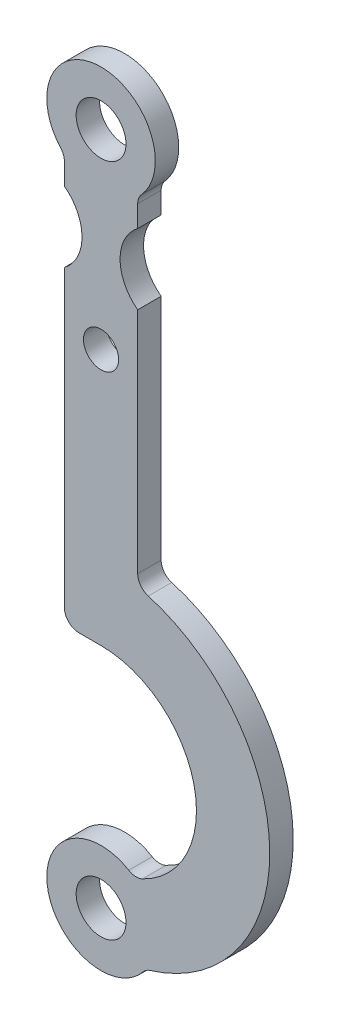
ISO-10303-21;
HEADER;
FILE_DESCRIPTION(('STEP AP214'),'2;1');
FILE_NAME('part.step','',(''),(''),'','','');
FILE_SCHEMA(('AUTOMOTIVE_DESIGN { 1 0 10303 214 1 1 1 1 }'));
ENDSEC;
DATA;
#1=APPLICATION_CONTEXT('core data for automotive mechanical design processes');
#2=APPLICATION_PROTOCOL_DEFINITION('international standard','automotive_design',2000,#1);
#3=PRODUCT_CONTEXT('',#1,'mechanical');
#4=PRODUCT('Part','Part','',(#3));
#5=PRODUCT_RELATED_PRODUCT_CATEGORY('part','',(#4));
#6=PRODUCT_DEFINITION_FORMATION('','',#4);
#7=PRODUCT_DEFINITION_CONTEXT('part definition',#1,'design');
#8=PRODUCT_DEFINITION('design','',#6,#7);
#9=PRODUCT_DEFINITION_SHAPE('','',#8);
#10=(LENGTH_UNIT() NAMED_UNIT(*) SI_UNIT(.MILLI.,.METRE.));
#11=(NAMED_UNIT(*) PLANE_ANGLE_UNIT() SI_UNIT($,.RADIAN.));
#12=(NAMED_UNIT(*) SI_UNIT($,.STERADIAN.) SOLID_ANGLE_UNIT());
#13=UNCERTAINTY_MEASURE_WITH_UNIT(LENGTH_MEASURE(1.E-05),#10,'distance_accuracy_value','');
#14=(GEOMETRIC_REPRESENTATION_CONTEXT(3) GLOBAL_UNCERTAINTY_ASSIGNED_CONTEXT((#13)) GLOBAL_UNIT_ASSIGNED_CONTEXT((#10,
#11,#12)) REPRESENTATION_CONTEXT('',''));
#15=CARTESIAN_POINT('',(0.,0.,0.));
#16=DIRECTION('',(0.,0.,1.));
#17=DIRECTION('',(1.,0.,0.));
#18=AXIS2_PLACEMENT_3D('',#15,#16,#17);
#19=CARTESIAN_POINT('',(0.,-230.,8.));
#20=DIRECTION('',(0.,0.,-1.));
#21=DIRECTION('',(-1.,0.,0.));
#22=AXIS2_PLACEMENT_3D('',#19,#20,#21);
#23=CYLINDRICAL_SURFACE('',#22,18.5);
#24=CARTESIAN_POINT('',(0.,-230.,0.));
#25=DIRECTION('',(0.,0.,1.));
#26=DIRECTION('',(1.,0.,0.));
#27=AXIS2_PLACEMENT_3D('',#24,#25,#26);
#28=CIRCLE('',#27,18.5);
#29=CARTESIAN_POINT('',(9.44463891587366,-214.092492472145,0.));
#30=VERTEX_POINT('',#29);
#31=CARTESIAN_POINT('',(14.3530284553606,-241.672213764304,0.));
#32=VERTEX_POINT('',#31);
#33=EDGE_CURVE('E240',#30,#32,#28,.T.);
#34=ORIENTED_EDGE('',*,*,#33,.T.);
#35=DIRECTION('',(0.,0.,-1.));
#36=VECTOR('',#35,1.);
#37=CARTESIAN_POINT('',(14.3530284553606,-241.672213764304,8.));
#38=LINE('',#37,#36);
#39=CARTESIAN_POINT('',(14.3530284553606,-241.672213764304,8.));
#40=VERTEX_POINT('',#39);
#41=EDGE_CURVE('E299',#32,#40,#38,.F.);
#42=ORIENTED_EDGE('',*,*,#41,.T.);
#43=CARTESIAN_POINT('',(0.,-230.,8.));
#44=DIRECTION('',(0.,0.,1.));
#45=DIRECTION('',(1.,0.,0.));
#46=AXIS2_PLACEMENT_3D('',#43,#44,#45);
#47=CIRCLE('',#46,18.5);
#48=CARTESIAN_POINT('',(9.44463891587366,-214.092492472145,8.));
#49=VERTEX_POINT('',#48);
#50=EDGE_CURVE('E445',#49,#40,#47,.T.);
#51=ORIENTED_EDGE('',*,*,#50,.F.);
#52=DIRECTION('',(0.,0.,-1.));
#53=VECTOR('',#52,1.);
#54=CARTESIAN_POINT('',(9.44463891587366,-214.092492472145,8.));
#55=LINE('',#54,#53);
#56=EDGE_CURVE('E295',#49,#30,#55,.T.);
#57=ORIENTED_EDGE('',*,*,#56,.T.);
#58=EDGE_LOOP('',(#34,#42,#51,#57));
#59=FACE_BOUND('',#58,.T.);
#60=ADVANCED_FACE('F49',(#59),#23,.T.);
#61=CARTESIAN_POINT('',(0.,-185.,8.));
#62=DIRECTION('',(0.,0.,-1.));
#63=DIRECTION('',(-1.,0.,0.));
#64=AXIS2_PLACEMENT_3D('',#61,#62,#63);
#65=CYLINDRICAL_SURFACE('',#64,57.5433285968466);
#66=CARTESIAN_POINT('',(0.,-185.,8.));
#67=DIRECTION('',(0.,0.,1.));
#68=DIRECTION('',(1.,0.,0.));
#69=AXIS2_PLACEMENT_3D('',#66,#67,#68);
#70=CIRCLE('',#69,57.5433285968466);
#71=CARTESIAN_POINT('',(16.7746577780857,-240.044032577862,8.));
#72=VERTEX_POINT('',#71);
#73=CARTESIAN_POINT('',(16.1009698881871,-129.755150152577,8.));
#74=VERTEX_POINT('',#73);
#75=EDGE_CURVE('E194',#72,#74,#70,.T.);
#76=ORIENTED_EDGE('',*,*,#75,.F.);
#77=DIRECTION('',(0.,0.,-1.));
#78=VECTOR('',#77,1.);
#79=CARTESIAN_POINT('',(16.7746577780857,-240.044032577862,8.));
#80=LINE('',#79,#78);
#81=CARTESIAN_POINT('',(16.7746577780857,-240.044032577862,0.));
#82=VERTEX_POINT('',#81);
#83=EDGE_CURVE('E291',#72,#82,#80,.T.);
#84=ORIENTED_EDGE('',*,*,#83,.T.);
#85=CARTESIAN_POINT('',(0.,-185.,0.));
#86=DIRECTION('',(0.,0.,1.));
#87=DIRECTION('',(1.,0.,0.));
#88=AXIS2_PLACEMENT_3D('',#85,#86,#87);
#89=CIRCLE('',#88,57.5433285968466);
#90=CARTESIAN_POINT('',(16.1009698881871,-129.755150152577,0.));
#91=VERTEX_POINT('',#90);
#92=EDGE_CURVE('E244',#82,#91,#89,.T.);
#93=ORIENTED_EDGE('',*,*,#92,.T.);
#94=DIRECTION('',(0.,0.,-1.));
#95=VECTOR('',#94,1.);
#96=CARTESIAN_POINT('',(16.1009698881871,-129.755150152577,8.));
#97=LINE('',#96,#95);
#98=EDGE_CURVE('E183',#91,#74,#97,.F.);
#99=ORIENTED_EDGE('',*,*,#98,.T.);
#100=EDGE_LOOP('',(#76,#84,#93,#99));
#101=FACE_BOUND('',#100,.T.);
#102=ADVANCED_FACE('F363',(#101),#65,.T.);
#103=CARTESIAN_POINT('',(12.5,0.,8.));
#104=DIRECTION('',(1.,0.,0.));
#105=DIRECTION('',(0.,1.,0.));
#106=AXIS2_PLACEMENT_3D('',#103,#104,#105);
#107=PLANE('',#106);
#108=DIRECTION('',(0.,-1.,0.));
#109=VECTOR('',#108,1.);
#110=CARTESIAN_POINT('',(12.5,0.,8.));
#111=LINE('',#110,#109);
#112=CARTESIAN_POINT('',(12.5,-47.,8.));
#113=VERTEX_POINT('',#112);
#114=CARTESIAN_POINT('',(12.5,-124.954867374839,8.));
#115=VERTEX_POINT('',#114);
#116=EDGE_CURVE('E174',#113,#115,#111,.T.);
#117=ORIENTED_EDGE('',*,*,#116,.T.);
#118=DIRECTION('',(0.,0.,-1.));
#119=VECTOR('',#118,1.);
#120=CARTESIAN_POINT('',(12.5,-124.954867374839,8.));
#121=LINE('',#120,#119);
#122=CARTESIAN_POINT('',(12.5,-124.954867374839,0.));
#123=VERTEX_POINT('',#122);
#124=EDGE_CURVE('E319',#115,#123,#121,.T.);
#125=ORIENTED_EDGE('',*,*,#124,.T.);
#126=DIRECTION('',(0.,-1.,0.));
#127=VECTOR('',#126,1.);
#128=CARTESIAN_POINT('',(12.5,0.,0.));
#129=LINE('',#128,#127);
#130=CARTESIAN_POINT('',(12.5,-47.,0.));
#131=VERTEX_POINT('',#130);
#132=EDGE_CURVE('E177',#131,#123,#129,.T.);
#133=ORIENTED_EDGE('',*,*,#132,.F.);
#134=DIRECTION('',(0.,0.,-1.));
#135=VECTOR('',#134,1.);
#136=CARTESIAN_POINT('',(12.5,-47.,8.));
#137=LINE('',#136,#135);
#138=EDGE_CURVE('E170',#113,#131,#137,.T.);
#139=ORIENTED_EDGE('',*,*,#138,.F.);
#140=EDGE_LOOP('',(#117,#125,#133,#139));
#141=FACE_BOUND('',#140,.T.);
#142=ADVANCED_FACE('F172',(#141),#107,.T.);
#143=CARTESIAN_POINT('',(21.5,-35.,8.));
#144=DIRECTION('',(0.,0.,-1.));
#145=DIRECTION('',(-1.,0.,0.));
#146=AXIS2_PLACEMENT_3D('',#143,#144,#145);
#147=CYLINDRICAL_SURFACE('',#146,15.);
#148=CARTESIAN_POINT('',(21.5,-35.,0.));
#149=DIRECTION('',(0.,0.,1.));
#150=DIRECTION('',(1.,0.,0.));
#151=AXIS2_PLACEMENT_3D('',#148,#149,#150);
#152=CIRCLE('',#151,15.);
#153=CARTESIAN_POINT('',(12.5,-23.,0.));
#154=VERTEX_POINT('',#153);
#155=EDGE_CURVE('E250',#154,#131,#152,.T.);
#156=ORIENTED_EDGE('',*,*,#155,.F.);
#157=DIRECTION('',(0.,0.,-1.));
#158=VECTOR('',#157,1.);
#159=CARTESIAN_POINT('',(12.5,-23.,8.));
#160=LINE('',#159,#158);
#161=CARTESIAN_POINT('',(12.5,-23.,8.));
#162=VERTEX_POINT('',#161);
#163=EDGE_CURVE('E184',#162,#154,#160,.T.);
#164=ORIENTED_EDGE('',*,*,#163,.F.);
#165=CARTESIAN_POINT('',(21.5,-35.,8.));
#166=DIRECTION('',(0.,0.,1.));
#167=DIRECTION('',(1.,0.,0.));
#168=AXIS2_PLACEMENT_3D('',#165,#166,#167);
#169=CIRCLE('',#168,15.);
#170=EDGE_CURVE('E190',#162,#113,#169,.T.);
#171=ORIENTED_EDGE('',*,*,#170,.T.);
#172=ORIENTED_EDGE('',*,*,#138,.T.);
#173=EDGE_LOOP('',(#156,#164,#171,#172));
#174=FACE_BOUND('',#173,.T.);
#175=ADVANCED_FACE('F197',(#174),#147,.F.);
#176=CARTESIAN_POINT('',(12.5,0.,8.));
#177=DIRECTION('',(1.,0.,0.));
#178=DIRECTION('',(0.,1.,0.));
#179=AXIS2_PLACEMENT_3D('',#176,#177,#178);
#180=PLANE('',#179);
#181=DIRECTION('',(0.,-1.,0.));
#182=VECTOR('',#181,1.);
#183=CARTESIAN_POINT('',(12.5,0.,0.));
#184=LINE('',#183,#182);
#185=CARTESIAN_POINT('',(12.5,-15.6843871413581,0.));
#186=VERTEX_POINT('',#185);
#187=EDGE_CURVE('E253',#186,#154,#184,.T.);
#188=ORIENTED_EDGE('',*,*,#187,.F.);
#189=DIRECTION('',(0.,0.,1.));
#190=VECTOR('',#189,1.);
#191=CARTESIAN_POINT('',(12.5,-15.6843871413581,8.));
#192=LINE('',#191,#190);
#193=CARTESIAN_POINT('',(12.5,-15.6843871413581,8.));
#194=VERTEX_POINT('',#193);
#195=EDGE_CURVE('E312',#186,#194,#192,.T.);
#196=ORIENTED_EDGE('',*,*,#195,.T.);
#197=DIRECTION('',(0.,-1.,0.));
#198=VECTOR('',#197,1.);
#199=CARTESIAN_POINT('',(12.5,0.,8.));
#200=LINE('',#199,#198);
#201=EDGE_CURVE('E200',#194,#162,#200,.T.);
#202=ORIENTED_EDGE('',*,*,#201,.T.);
#203=ORIENTED_EDGE('',*,*,#163,.T.);
#204=EDGE_LOOP('',(#188,#196,#202,#203));
#205=FACE_BOUND('',#204,.T.);
#206=ADVANCED_FACE('F494',(#205),#180,.T.);
#207=CARTESIAN_POINT('',(0.,0.,8.));
#208=DIRECTION('',(0.,0.,-1.));
#209=DIRECTION('',(-1.,0.,0.));
#210=AXIS2_PLACEMENT_3D('',#207,#208,#209);
#211=CYLINDRICAL_SURFACE('',#210,18.5);
#212=CARTESIAN_POINT('',(0.,0.,8.));
#213=DIRECTION('',(0.,0.,1.));
#214=DIRECTION('',(1.,0.,0.));
#215=AXIS2_PLACEMENT_3D('',#212,#213,#214);
#216=CIRCLE('',#215,18.5);
#217=CARTESIAN_POINT('',(-13.7765957446809,-12.3472834942607,8.));
#218=VERTEX_POINT('',#217);
#219=CARTESIAN_POINT('',(13.7765957446809,-12.3472834942607,8.));
#220=VERTEX_POINT('',#219);
#221=EDGE_CURVE('E203',#218,#220,#216,.F.);
#222=ORIENTED_EDGE('',*,*,#221,.T.);
#223=DIRECTION('',(0.,0.,-1.));
#224=VECTOR('',#223,1.);
#225=CARTESIAN_POINT('',(13.7765957446809,-12.3472834942607,8.));
#226=LINE('',#225,#224);
#227=CARTESIAN_POINT('',(13.7765957446809,-12.3472834942607,0.));
#228=VERTEX_POINT('',#227);
#229=EDGE_CURVE('E308',#220,#228,#226,.T.);
#230=ORIENTED_EDGE('',*,*,#229,.T.);
#231=CARTESIAN_POINT('',(0.,0.,0.));
#232=DIRECTION('',(0.,0.,1.));
#233=DIRECTION('',(1.,0.,0.));
#234=AXIS2_PLACEMENT_3D('',#231,#232,#233);
#235=CIRCLE('',#234,18.5);
#236=CARTESIAN_POINT('',(-13.7765957446809,-12.3472834942607,0.));
#237=VERTEX_POINT('',#236);
#238=EDGE_CURVE('E256',#237,#228,#235,.F.);
#239=ORIENTED_EDGE('',*,*,#238,.F.);
#240=DIRECTION('',(0.,0.,-1.));
#241=VECTOR('',#240,1.);
#242=CARTESIAN_POINT('',(-13.7765957446809,-12.3472834942607,8.));
#243=LINE('',#242,#241);
#244=EDGE_CURVE('E305',#237,#218,#243,.F.);
#245=ORIENTED_EDGE('',*,*,#244,.T.);
#246=EDGE_LOOP('',(#222,#230,#239,#245));
#247=FACE_BOUND('',#246,.T.);
#248=ADVANCED_FACE('F417',(#247),#211,.T.);
#249=CARTESIAN_POINT('',(-12.5,0.,8.));
#250=DIRECTION('',(1.,0.,0.));
#251=DIRECTION('',(0.,1.,0.));
#252=AXIS2_PLACEMENT_3D('',#249,#250,#251);
#253=PLANE('',#252);
#254=DIRECTION('',(0.,-1.,0.));
#255=VECTOR('',#254,1.);
#256=CARTESIAN_POINT('',(-12.5,0.,8.));
#257=LINE('',#256,#255);
#258=CARTESIAN_POINT('',(-12.5,-15.6843871413581,8.));
#259=VERTEX_POINT('',#258);
#260=CARTESIAN_POINT('',(-12.5,-23.,8.));
#261=VERTEX_POINT('',#260);
#262=EDGE_CURVE('E210',#259,#261,#257,.T.);
#263=ORIENTED_EDGE('',*,*,#262,.F.);
#264=DIRECTION('',(0.,0.,-1.));
#265=VECTOR('',#264,1.);
#266=CARTESIAN_POINT('',(-12.5,-15.6843871413581,8.));
#267=LINE('',#266,#265);
#268=CARTESIAN_POINT('',(-12.5,-15.6843871413581,0.));
#269=VERTEX_POINT('',#268);
#270=EDGE_CURVE('E315',#259,#269,#267,.T.);
#271=ORIENTED_EDGE('',*,*,#270,.T.);
#272=DIRECTION('',(0.,-1.,0.));
#273=VECTOR('',#272,1.);
#274=CARTESIAN_POINT('',(-12.5,0.,0.));
#275=LINE('',#274,#273);
#276=CARTESIAN_POINT('',(-12.5,-23.,0.));
#277=VERTEX_POINT('',#276);
#278=EDGE_CURVE('E260',#269,#277,#275,.T.);
#279=ORIENTED_EDGE('',*,*,#278,.T.);
#280=DIRECTION('',(0.,0.,-1.));
#281=VECTOR('',#280,1.);
#282=CARTESIAN_POINT('',(-12.5,-23.,8.));
#283=LINE('',#282,#281);
#284=EDGE_CURVE('E283',#261,#277,#283,.T.);
#285=ORIENTED_EDGE('',*,*,#284,.F.);
#286=EDGE_LOOP('',(#263,#271,#279,#285));
#287=FACE_BOUND('',#286,.T.);
#288=ADVANCED_FACE('F424',(#287),#253,.F.);
#289=CARTESIAN_POINT('',(-21.5,-35.,8.));
#290=DIRECTION('',(0.,0.,-1.));
#291=DIRECTION('',(-1.,0.,0.));
#292=AXIS2_PLACEMENT_3D('',#289,#290,#291);
#293=CYLINDRICAL_SURFACE('',#292,15.);
#294=CARTESIAN_POINT('',(-21.5,-35.,0.));
#295=DIRECTION('',(0.,0.,1.));
#296=DIRECTION('',(1.,0.,0.));
#297=AXIS2_PLACEMENT_3D('',#294,#295,#296);
#298=CIRCLE('',#297,15.);
#299=CARTESIAN_POINT('',(-12.5,-47.,0.));
#300=VERTEX_POINT('',#299);
#301=EDGE_CURVE('E263',#277,#300,#298,.F.);
#302=ORIENTED_EDGE('',*,*,#301,.T.);
#303=DIRECTION('',(0.,0.,-1.));
#304=VECTOR('',#303,1.);
#305=CARTESIAN_POINT('',(-12.5,-47.,8.));
#306=LINE('',#305,#304);
#307=CARTESIAN_POINT('',(-12.5,-47.,8.));
#308=VERTEX_POINT('',#307);
#309=EDGE_CURVE('E279',#308,#300,#306,.T.);
#310=ORIENTED_EDGE('',*,*,#309,.F.);
#311=CARTESIAN_POINT('',(-21.5,-35.,8.));
#312=DIRECTION('',(0.,0.,1.));
#313=DIRECTION('',(1.,0.,0.));
#314=AXIS2_PLACEMENT_3D('',#311,#312,#313);
#315=CIRCLE('',#314,15.);
#316=EDGE_CURVE('E213',#261,#308,#315,.F.);
#317=ORIENTED_EDGE('',*,*,#316,.F.);
#318=ORIENTED_EDGE('',*,*,#284,.T.);
#319=EDGE_LOOP('',(#302,#310,#317,#318));
#320=FACE_BOUND('',#319,.T.);
#321=ADVANCED_FACE('F430',(#320),#293,.F.);
#322=CARTESIAN_POINT('',(-12.5,0.,8.));
#323=DIRECTION('',(1.,0.,0.));
#324=DIRECTION('',(0.,1.,0.));
#325=AXIS2_PLACEMENT_3D('',#322,#323,#324);
#326=PLANE('',#325);
#327=DIRECTION('',(0.,-1.,0.));
#328=VECTOR('',#327,1.);
#329=CARTESIAN_POINT('',(-12.5,0.,0.));
#330=LINE('',#329,#328);
#331=CARTESIAN_POINT('',(-12.5,-147.456671403153,0.));
#332=VERTEX_POINT('',#331);
#333=EDGE_CURVE('E266',#300,#332,#330,.T.);
#334=ORIENTED_EDGE('',*,*,#333,.T.);
#335=DIRECTION('',(0.,0.,-1.));
#336=VECTOR('',#335,1.);
#337=CARTESIAN_POINT('',(-12.5,-147.456671403153,8.));
#338=LINE('',#337,#336);
#339=CARTESIAN_POINT('',(-12.5,-147.456671403153,8.));
#340=VERTEX_POINT('',#339);
#341=EDGE_CURVE('E65',#332,#340,#338,.F.);
#342=ORIENTED_EDGE('',*,*,#341,.T.);
#343=DIRECTION('',(0.,-1.,0.));
#344=VECTOR('',#343,1.);
#345=CARTESIAN_POINT('',(-12.5,0.,8.));
#346=LINE('',#345,#344);
#347=EDGE_CURVE('E216',#308,#340,#346,.T.);
#348=ORIENTED_EDGE('',*,*,#347,.F.);
#349=ORIENTED_EDGE('',*,*,#309,.T.);
#350=EDGE_LOOP('',(#334,#342,#348,#349));
#351=FACE_BOUND('',#350,.T.);
#352=ADVANCED_FACE('F485',(#351),#326,.F.);
#353=CARTESIAN_POINT('',(0.,-152.456671403153,8.));
#354=DIRECTION('',(0.,-1.,0.));
#355=DIRECTION('',(0.,0.,-1.));
#356=AXIS2_PLACEMENT_3D('',#353,#354,#355);
#357=PLANE('',#356);
#358=DIRECTION('',(-1.,0.,0.));
#359=VECTOR('',#358,1.);
#360=CARTESIAN_POINT('',(0.,-152.456671403153,8.));
#361=LINE('',#360,#359);
#362=CARTESIAN_POINT('',(0.,-152.456671403153,8.));
#363=VERTEX_POINT('',#362);
#364=CARTESIAN_POINT('',(-7.49999999999999,-152.456671403153,8.));
#365=VERTEX_POINT('',#364);
#366=EDGE_CURVE('E219',#363,#365,#361,.T.);
#367=ORIENTED_EDGE('',*,*,#366,.T.);
#368=DIRECTION('',(0.,0.,-1.));
#369=VECTOR('',#368,1.);
#370=CARTESIAN_POINT('',(-7.49999999999999,-152.456671403153,0.));
#371=LINE('',#370,#369);
#372=CARTESIAN_POINT('',(-7.49999999999999,-152.456671403153,0.));
#373=VERTEX_POINT('',#372);
#374=EDGE_CURVE('E322',#365,#373,#371,.T.);
#375=ORIENTED_EDGE('',*,*,#374,.T.);
#376=DIRECTION('',(-1.,0.,0.));
#377=VECTOR('',#376,1.);
#378=CARTESIAN_POINT('',(0.,-152.456671403153,0.));
#379=LINE('',#378,#377);
#380=CARTESIAN_POINT('',(0.,-152.456671403153,0.));
#381=VERTEX_POINT('',#380);
#382=EDGE_CURVE('E269',#381,#373,#379,.T.);
#383=ORIENTED_EDGE('',*,*,#382,.F.);
#384=DIRECTION('',(0.,0.,-1.));
#385=VECTOR('',#384,1.);
#386=CARTESIAN_POINT('',(0.,-152.456671403153,8.));
#387=LINE('',#386,#385);
#388=EDGE_CURVE('E227',#363,#381,#387,.T.);
#389=ORIENTED_EDGE('',*,*,#388,.F.);
#390=EDGE_LOOP('',(#367,#375,#383,#389));
#391=FACE_BOUND('',#390,.T.);
#392=ADVANCED_FACE('F390',(#391),#357,.T.);
#393=CARTESIAN_POINT('',(0.,0.,8.));
#394=DIRECTION('',(0.,0.,-1.));
#395=DIRECTION('',(-1.,0.,0.));
#396=AXIS2_PLACEMENT_3D('',#393,#394,#395);
#397=CYLINDRICAL_SURFACE('',#396,8.5);
#398=CARTESIAN_POINT('',(0.,0.,8.));
#399=DIRECTION('',(0.,0.,1.));
#400=DIRECTION('',(1.,0.,0.));
#401=AXIS2_PLACEMENT_3D('',#398,#399,#400);
#402=CIRCLE('',#401,8.5);
#403=CARTESIAN_POINT('',(8.5,0.,8.));
#404=VERTEX_POINT('',#403);
#405=EDGE_CURVE('E449',#404,#404,#402,.T.);
#406=ORIENTED_EDGE('',*,*,#405,.T.);
#407=EDGE_LOOP('',(#406));
#408=FACE_BOUND('',#407,.T.);
#409=CARTESIAN_POINT('',(0.,0.,0.));
#410=DIRECTION('',(0.,0.,1.));
#411=DIRECTION('',(1.,0.,0.));
#412=AXIS2_PLACEMENT_3D('',#409,#410,#411);
#413=CIRCLE('',#412,8.5);
#414=CARTESIAN_POINT('',(8.5,0.,0.));
#415=VERTEX_POINT('',#414);
#416=EDGE_CURVE('E236',#415,#415,#413,.T.);
#417=ORIENTED_EDGE('',*,*,#416,.F.);
#418=EDGE_LOOP('',(#417));
#419=FACE_BOUND('',#418,.T.);
#420=ADVANCED_FACE('F386',(#408,#419),#397,.F.);
#421=CARTESIAN_POINT('',(0.,-230.,8.));
#422=DIRECTION('',(0.,0.,-1.));
#423=DIRECTION('',(-1.,0.,0.));
#424=AXIS2_PLACEMENT_3D('',#421,#422,#423);
#425=CYLINDRICAL_SURFACE('',#424,8.50000000000001);
#426=CARTESIAN_POINT('',(0.,-230.,8.));
#427=DIRECTION('',(0.,0.,1.));
#428=DIRECTION('',(1.,0.,0.));
#429=AXIS2_PLACEMENT_3D('',#426,#427,#428);
#430=CIRCLE('',#429,8.50000000000001);
#431=CARTESIAN_POINT('',(8.50000000000001,-230.,8.));
#432=VERTEX_POINT('',#431);
#433=EDGE_CURVE('E454',#432,#432,#430,.T.);
#434=ORIENTED_EDGE('',*,*,#433,.T.);
#435=EDGE_LOOP('',(#434));
#436=FACE_BOUND('',#435,.T.);
#437=CARTESIAN_POINT('',(0.,-230.,0.));
#438=DIRECTION('',(0.,0.,1.));
#439=DIRECTION('',(1.,0.,0.));
#440=AXIS2_PLACEMENT_3D('',#437,#438,#439);
#441=CIRCLE('',#440,8.50000000000001);
#442=CARTESIAN_POINT('',(8.50000000000001,-230.,0.));
#443=VERTEX_POINT('',#442);
#444=EDGE_CURVE('E232',#443,#443,#441,.T.);
#445=ORIENTED_EDGE('',*,*,#444,.F.);
#446=EDGE_LOOP('',(#445));
#447=FACE_BOUND('',#446,.T.);
#448=ADVANCED_FACE('F389',(#436,#447),#425,.F.);
#449=CARTESIAN_POINT('',(0.,-65.,8.));
#450=DIRECTION('',(0.,0.,-1.));
#451=DIRECTION('',(-1.,0.,0.));
#452=AXIS2_PLACEMENT_3D('',#449,#450,#451);
#453=CYLINDRICAL_SURFACE('',#452,6.);
#454=CARTESIAN_POINT('',(0.,-65.,8.));
#455=DIRECTION('',(0.,0.,1.));
#456=DIRECTION('',(1.,0.,0.));
#457=AXIS2_PLACEMENT_3D('',#454,#455,#456);
#458=CIRCLE('',#457,6.);
#459=CARTESIAN_POINT('',(6.,-65.,8.));
#460=VERTEX_POINT('',#459);
#461=EDGE_CURVE('E276',#460,#460,#458,.T.);
#462=ORIENTED_EDGE('',*,*,#461,.T.);
#463=EDGE_LOOP('',(#462));
#464=FACE_BOUND('',#463,.T.);
#465=CARTESIAN_POINT('',(0.,-65.,0.));
#466=DIRECTION('',(0.,0.,1.));
#467=DIRECTION('',(1.,0.,0.));
#468=AXIS2_PLACEMENT_3D('',#465,#466,#467);
#469=CIRCLE('',#468,6.);
#470=CARTESIAN_POINT('',(6.,-65.,0.));
#471=VERTEX_POINT('',#470);
#472=EDGE_CURVE('E228',#471,#471,#469,.T.);
#473=ORIENTED_EDGE('',*,*,#472,.F.);
#474=EDGE_LOOP('',(#473));
#475=FACE_BOUND('',#474,.T.);
#476=ADVANCED_FACE('F394',(#464,#475),#453,.F.);
#477=CARTESIAN_POINT('',(0.,-185.,8.));
#478=DIRECTION('',(0.,0.,-1.));
#479=DIRECTION('',(-1.,0.,0.));
#480=AXIS2_PLACEMENT_3D('',#477,#478,#479);
#481=CYLINDRICAL_SURFACE('',#480,32.5433285968467);
#482=CARTESIAN_POINT('',(0.,-185.,0.));
#483=DIRECTION('',(0.,0.,1.));
#484=DIRECTION('',(1.,0.,0.));
#485=AXIS2_PLACEMENT_3D('',#482,#483,#484);
#486=CIRCLE('',#485,32.5433285968467);
#487=CARTESIAN_POINT('',(14.1751296796172,-214.293923170657,0.));
#488=VERTEX_POINT('',#487);
#489=EDGE_CURVE('E272',#381,#488,#486,.F.);
#490=ORIENTED_EDGE('',*,*,#489,.T.);
#491=DIRECTION('',(0.,0.,-1.));
#492=VECTOR('',#491,1.);
#493=CARTESIAN_POINT('',(14.1751296796172,-214.293923170657,8.));
#494=LINE('',#493,#492);
#495=CARTESIAN_POINT('',(14.1751296796172,-214.293923170657,8.));
#496=VERTEX_POINT('',#495);
#497=EDGE_CURVE('E302',#488,#496,#494,.F.);
#498=ORIENTED_EDGE('',*,*,#497,.T.);
#499=CARTESIAN_POINT('',(0.,-185.,8.));
#500=DIRECTION('',(0.,0.,1.));
#501=DIRECTION('',(1.,0.,0.));
#502=AXIS2_PLACEMENT_3D('',#499,#500,#501);
#503=CIRCLE('',#502,32.5433285968467);
#504=EDGE_CURVE('E223',#363,#496,#503,.F.);
#505=ORIENTED_EDGE('',*,*,#504,.F.);
#506=ORIENTED_EDGE('',*,*,#388,.T.);
#507=EDGE_LOOP('',(#490,#498,#505,#506));
#508=FACE_BOUND('',#507,.T.);
#509=ADVANCED_FACE('F397',(#508),#481,.F.);
#510=CARTESIAN_POINT('',(0.,0.,8.));
#511=DIRECTION('',(0.,0.,1.));
#512=DIRECTION('',(1.,0.,0.));
#513=AXIS2_PLACEMENT_3D('',#510,#511,#512);
#514=PLANE('',#513);
#515=ORIENTED_EDGE('',*,*,#461,.F.);
#516=EDGE_LOOP('',(#515));
#517=FACE_BOUND('',#516,.T.);
#518=ORIENTED_EDGE('',*,*,#433,.F.);
#519=EDGE_LOOP('',(#518));
#520=FACE_BOUND('',#519,.T.);
#521=ORIENTED_EDGE('',*,*,#405,.F.);
#522=EDGE_LOOP('',(#521));
#523=FACE_BOUND('',#522,.T.);
#524=ORIENTED_EDGE('',*,*,#347,.T.);
#525=CARTESIAN_POINT('',(-7.49999999999999,-147.456671403153,8.));
#526=DIRECTION('',(0.,0.,1.));
#527=DIRECTION('',(1.,0.,0.));
#528=AXIS2_PLACEMENT_3D('',#525,#526,#527);
#529=CIRCLE('',#528,5.);
#530=EDGE_CURVE('E330',#340,#365,#529,.T.);
#531=ORIENTED_EDGE('',*,*,#530,.T.);
#532=ORIENTED_EDGE('',*,*,#366,.F.);
#533=ORIENTED_EDGE('',*,*,#504,.T.);
#534=CARTESIAN_POINT('',(11.997244028272,-209.793166113265,8.));
#535=DIRECTION('',(0.,0.,1.));
#536=DIRECTION('',(1.,0.,0.));
#537=AXIS2_PLACEMENT_3D('',#534,#535,#536);
#538=CIRCLE('',#537,5.);
#539=EDGE_CURVE('E342',#496,#49,#538,.F.);
#540=ORIENTED_EDGE('',*,*,#539,.T.);
#541=ORIENTED_EDGE('',*,*,#50,.T.);
#542=CARTESIAN_POINT('',(18.2322253351878,-244.826866133035,8.));
#543=DIRECTION('',(0.,0.,1.));
#544=DIRECTION('',(1.,0.,0.));
#545=AXIS2_PLACEMENT_3D('',#542,#543,#544);
#546=CIRCLE('',#545,5.);
#547=EDGE_CURVE('E336',#40,#72,#546,.F.);
#548=ORIENTED_EDGE('',*,*,#547,.T.);
#549=ORIENTED_EDGE('',*,*,#75,.T.);
#550=CARTESIAN_POINT('',(17.5,-124.954867374839,8.));
#551=DIRECTION('',(0.,0.,1.));
#552=DIRECTION('',(1.,0.,0.));
#553=AXIS2_PLACEMENT_3D('',#550,#551,#552);
#554=CIRCLE('',#553,5.);
#555=EDGE_CURVE('E11',#74,#115,#554,.F.);
#556=ORIENTED_EDGE('',*,*,#555,.T.);
#557=ORIENTED_EDGE('',*,*,#116,.F.);
#558=ORIENTED_EDGE('',*,*,#170,.F.);
#559=ORIENTED_EDGE('',*,*,#201,.F.);
#560=CARTESIAN_POINT('',(17.5,-15.6843871413581,8.));
#561=DIRECTION('',(0.,0.,1.));
#562=DIRECTION('',(1.,0.,0.));
#563=AXIS2_PLACEMENT_3D('',#560,#561,#562);
#564=CIRCLE('',#563,5.);
#565=EDGE_CURVE('E348',#194,#220,#564,.F.);
#566=ORIENTED_EDGE('',*,*,#565,.T.);
#567=ORIENTED_EDGE('',*,*,#221,.F.);
#568=CARTESIAN_POINT('',(-17.5,-15.6843871413581,8.));
#569=DIRECTION('',(0.,0.,1.));
#570=DIRECTION('',(1.,0.,0.));
#571=AXIS2_PLACEMENT_3D('',#568,#569,#570);
#572=CIRCLE('',#571,5.);
#573=EDGE_CURVE('E354',#218,#259,#572,.F.);
#574=ORIENTED_EDGE('',*,*,#573,.T.);
#575=ORIENTED_EDGE('',*,*,#262,.T.);
#576=ORIENTED_EDGE('',*,*,#316,.T.);
#577=EDGE_LOOP('',(#524,#531,#532,#533,#540,#541,#548,#549,#556,#557,#558,#559,#566,#567,#574,
#575,#576));
#578=FACE_BOUND('',#577,.T.);
#579=ADVANCED_FACE('F188',(#517,#520,#523,#578),#514,.T.);
#580=CARTESIAN_POINT('',(0.,0.,0.));
#581=DIRECTION('',(0.,0.,1.));
#582=DIRECTION('',(1.,0.,0.));
#583=AXIS2_PLACEMENT_3D('',#580,#581,#582);
#584=PLANE('',#583);
#585=ORIENTED_EDGE('',*,*,#472,.T.);
#586=EDGE_LOOP('',(#585));
#587=FACE_BOUND('',#586,.T.);
#588=ORIENTED_EDGE('',*,*,#444,.T.);
#589=EDGE_LOOP('',(#588));
#590=FACE_BOUND('',#589,.T.);
#591=ORIENTED_EDGE('',*,*,#416,.T.);
#592=EDGE_LOOP('',(#591));
#593=FACE_BOUND('',#592,.T.);
#594=ORIENTED_EDGE('',*,*,#382,.T.);
#595=CARTESIAN_POINT('',(-7.49999999999999,-147.456671403153,0.));
#596=DIRECTION('',(0.,0.,1.));
#597=DIRECTION('',(1.,0.,0.));
#598=AXIS2_PLACEMENT_3D('',#595,#596,#597);
#599=CIRCLE('',#598,5.);
#600=EDGE_CURVE('E73',#373,#332,#599,.F.);
#601=ORIENTED_EDGE('',*,*,#600,.T.);
#602=ORIENTED_EDGE('',*,*,#333,.F.);
#603=ORIENTED_EDGE('',*,*,#301,.F.);
#604=ORIENTED_EDGE('',*,*,#278,.F.);
#605=CARTESIAN_POINT('',(-17.5,-15.6843871413581,0.));
#606=DIRECTION('',(0.,0.,1.));
#607=DIRECTION('',(1.,0.,0.));
#608=AXIS2_PLACEMENT_3D('',#605,#606,#607);
#609=CIRCLE('',#608,5.);
#610=EDGE_CURVE('E351',#269,#237,#609,.T.);
#611=ORIENTED_EDGE('',*,*,#610,.T.);
#612=ORIENTED_EDGE('',*,*,#238,.T.);
#613=CARTESIAN_POINT('',(17.5,-15.6843871413581,0.));
#614=DIRECTION('',(0.,0.,1.));
#615=DIRECTION('',(1.,0.,0.));
#616=AXIS2_PLACEMENT_3D('',#613,#614,#615);
#617=CIRCLE('',#616,5.);
#618=EDGE_CURVE('E345',#228,#186,#617,.T.);
#619=ORIENTED_EDGE('',*,*,#618,.T.);
#620=ORIENTED_EDGE('',*,*,#187,.T.);
#621=ORIENTED_EDGE('',*,*,#155,.T.);
#622=ORIENTED_EDGE('',*,*,#132,.T.);
#623=CARTESIAN_POINT('',(17.5,-124.954867374839,0.));
#624=DIRECTION('',(0.,0.,1.));
#625=DIRECTION('',(1.,0.,0.));
#626=AXIS2_PLACEMENT_3D('',#623,#624,#625);
#627=CIRCLE('',#626,5.);
#628=EDGE_CURVE('E58',#123,#91,#627,.T.);
#629=ORIENTED_EDGE('',*,*,#628,.T.);
#630=ORIENTED_EDGE('',*,*,#92,.F.);
#631=CARTESIAN_POINT('',(18.2322253351878,-244.826866133035,0.));
#632=DIRECTION('',(0.,0.,1.));
#633=DIRECTION('',(1.,0.,0.));
#634=AXIS2_PLACEMENT_3D('',#631,#632,#633);
#635=CIRCLE('',#634,5.);
#636=EDGE_CURVE('E333',#82,#32,#635,.T.);
#637=ORIENTED_EDGE('',*,*,#636,.T.);
#638=ORIENTED_EDGE('',*,*,#33,.F.);
#639=CARTESIAN_POINT('',(11.997244028272,-209.793166113265,0.));
#640=DIRECTION('',(0.,0.,1.));
#641=DIRECTION('',(1.,0.,0.));
#642=AXIS2_PLACEMENT_3D('',#639,#640,#641);
#643=CIRCLE('',#642,5.);
#644=EDGE_CURVE('E339',#30,#488,#643,.T.);
#645=ORIENTED_EDGE('',*,*,#644,.T.);
#646=ORIENTED_EDGE('',*,*,#489,.F.);
#647=EDGE_LOOP('',(#594,#601,#602,#603,#604,#611,#612,#619,#620,#621,#622,#629,#630,#637,#638,
#645,#646));
#648=FACE_BOUND('',#647,.T.);
#649=ADVANCED_FACE('F358',(#587,#590,#593,#648),#584,.F.);
#650=CARTESIAN_POINT('',(18.2322253351878,-244.826866133035,8.));
#651=DIRECTION('',(0.,0.,1.));
#652=DIRECTION('',(1.,0.,0.));
#653=AXIS2_PLACEMENT_3D('',#650,#651,#652);
#654=CYLINDRICAL_SURFACE('',#653,5.);
#655=ORIENTED_EDGE('',*,*,#547,.F.);
#656=ORIENTED_EDGE('',*,*,#41,.F.);
#657=ORIENTED_EDGE('',*,*,#636,.F.);
#658=ORIENTED_EDGE('',*,*,#83,.F.);
#659=EDGE_LOOP('',(#655,#656,#657,#658));
#660=FACE_BOUND('',#659,.T.);
#661=ADVANCED_FACE('F399',(#660),#654,.F.);
#662=CARTESIAN_POINT('',(11.997244028272,-209.793166113265,8.));
#663=DIRECTION('',(0.,0.,-1.));
#664=DIRECTION('',(-1.,0.,0.));
#665=AXIS2_PLACEMENT_3D('',#662,#663,#664);
#666=CYLINDRICAL_SURFACE('',#665,5.);
#667=ORIENTED_EDGE('',*,*,#539,.F.);
#668=ORIENTED_EDGE('',*,*,#497,.F.);
#669=ORIENTED_EDGE('',*,*,#644,.F.);
#670=ORIENTED_EDGE('',*,*,#56,.F.);
#671=EDGE_LOOP('',(#667,#668,#669,#670));
#672=FACE_BOUND('',#671,.T.);
#673=ADVANCED_FACE('F402',(#672),#666,.F.);
#674=CARTESIAN_POINT('',(17.5,-15.6843871413581,8.));
#675=DIRECTION('',(0.,0.,-1.));
#676=DIRECTION('',(-1.,0.,0.));
#677=AXIS2_PLACEMENT_3D('',#674,#675,#676);
#678=CYLINDRICAL_SURFACE('',#677,5.);
#679=ORIENTED_EDGE('',*,*,#565,.F.);
#680=ORIENTED_EDGE('',*,*,#195,.F.);
#681=ORIENTED_EDGE('',*,*,#618,.F.);
#682=ORIENTED_EDGE('',*,*,#229,.F.);
#683=EDGE_LOOP('',(#679,#680,#681,#682));
#684=FACE_BOUND('',#683,.T.);
#685=ADVANCED_FACE('F373',(#684),#678,.F.);
#686=CARTESIAN_POINT('',(-17.5,-15.6843871413581,8.));
#687=DIRECTION('',(0.,0.,-1.));
#688=DIRECTION('',(-1.,0.,0.));
#689=AXIS2_PLACEMENT_3D('',#686,#687,#688);
#690=CYLINDRICAL_SURFACE('',#689,5.);
#691=ORIENTED_EDGE('',*,*,#573,.F.);
#692=ORIENTED_EDGE('',*,*,#244,.F.);
#693=ORIENTED_EDGE('',*,*,#610,.F.);
#694=ORIENTED_EDGE('',*,*,#270,.F.);
#695=EDGE_LOOP('',(#691,#692,#693,#694));
#696=FACE_BOUND('',#695,.T.);
#697=ADVANCED_FACE('F367',(#696),#690,.F.);
#698=CARTESIAN_POINT('',(17.5,-124.954867374839,8.));
#699=DIRECTION('',(0.,0.,-1.));
#700=DIRECTION('',(-1.,0.,0.));
#701=AXIS2_PLACEMENT_3D('',#698,#699,#700);
#702=CYLINDRICAL_SURFACE('',#701,5.);
#703=ORIENTED_EDGE('',*,*,#555,.F.);
#704=ORIENTED_EDGE('',*,*,#98,.F.);
#705=ORIENTED_EDGE('',*,*,#628,.F.);
#706=ORIENTED_EDGE('',*,*,#124,.F.);
#707=EDGE_LOOP('',(#703,#704,#705,#706));
#708=FACE_BOUND('',#707,.T.);
#709=ADVANCED_FACE('F365',(#708),#702,.F.);
#710=CARTESIAN_POINT('',(-7.49999999999999,-147.456671403153,8.));
#711=DIRECTION('',(0.,0.,1.));
#712=DIRECTION('',(1.,0.,0.));
#713=AXIS2_PLACEMENT_3D('',#710,#711,#712);
#714=CYLINDRICAL_SURFACE('',#713,5.);
#715=ORIENTED_EDGE('',*,*,#530,.F.);
#716=ORIENTED_EDGE('',*,*,#341,.F.);
#717=ORIENTED_EDGE('',*,*,#600,.F.);
#718=ORIENTED_EDGE('',*,*,#374,.F.);
#719=EDGE_LOOP('',(#715,#716,#717,#718));
#720=FACE_BOUND('',#719,.T.);
#721=ADVANCED_FACE('F51',(#720),#714,.T.);
#722=CLOSED_SHELL('',(#60,#102,#142,#175,#206,#248,#288,#321,#352,#392,#420,#448,#476,#509,#579,
#649,#661,#673,#685,#697,#709,#721));
#723=MANIFOLD_SOLID_BREP('B2',#722);
#724=ADVANCED_BREP_SHAPE_REPRESENTATION('',(#18,#723),#14);
#725=SHAPE_DEFINITION_REPRESENTATION(#9,#724);
ENDSEC;
END-ISO-10303-21;
